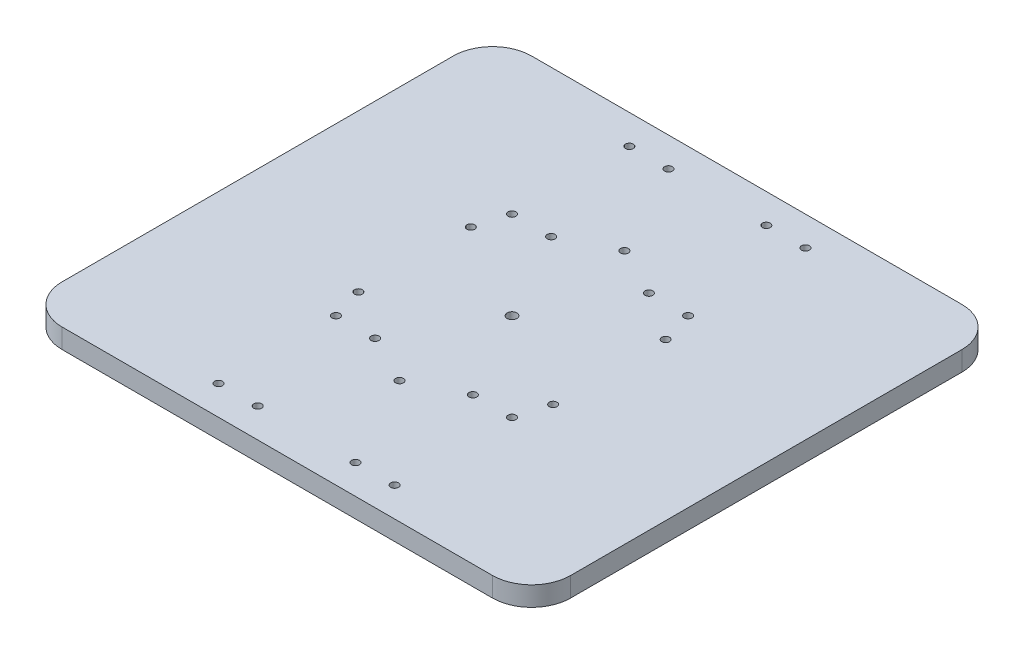
ISO-10303-21;
HEADER;
FILE_DESCRIPTION(('STEP AP214'),'2;1');
FILE_NAME('part.step','',(''),(''),'','','');
FILE_SCHEMA(('AUTOMOTIVE_DESIGN { 1 0 10303 214 1 1 1 1 }'));
ENDSEC;
DATA;
#1=APPLICATION_CONTEXT('core data for automotive mechanical design processes');
#2=APPLICATION_PROTOCOL_DEFINITION('international standard','automotive_design',2000,#1);
#3=PRODUCT_CONTEXT('',#1,'mechanical');
#4=PRODUCT('Part','Part','',(#3));
#5=PRODUCT_RELATED_PRODUCT_CATEGORY('part','',(#4));
#6=PRODUCT_DEFINITION_FORMATION('','',#4);
#7=PRODUCT_DEFINITION_CONTEXT('part definition',#1,'design');
#8=PRODUCT_DEFINITION('design','',#6,#7);
#9=PRODUCT_DEFINITION_SHAPE('','',#8);
#10=(LENGTH_UNIT() NAMED_UNIT(*) SI_UNIT(.MILLI.,.METRE.));
#11=(NAMED_UNIT(*) PLANE_ANGLE_UNIT() SI_UNIT($,.RADIAN.));
#12=(NAMED_UNIT(*) SI_UNIT($,.STERADIAN.) SOLID_ANGLE_UNIT());
#13=UNCERTAINTY_MEASURE_WITH_UNIT(LENGTH_MEASURE(1.E-05),#10,'distance_accuracy_value','');
#14=(GEOMETRIC_REPRESENTATION_CONTEXT(3) GLOBAL_UNCERTAINTY_ASSIGNED_CONTEXT((#13)) GLOBAL_UNIT_ASSIGNED_CONTEXT((#10,
#11,#12)) REPRESENTATION_CONTEXT('',''));
#15=CARTESIAN_POINT('',(0.,0.,0.));
#16=DIRECTION('',(0.,0.,1.));
#17=DIRECTION('',(1.,0.,0.));
#18=AXIS2_PLACEMENT_3D('',#15,#16,#17);
#19=CARTESIAN_POINT('',(130.,10.,120.));
#20=DIRECTION('',(-1.,0.,0.));
#21=DIRECTION('',(0.,0.,1.));
#22=AXIS2_PLACEMENT_3D('',#19,#20,#21);
#23=PLANE('',#22);
#24=DIRECTION('',(0.,0.,-1.));
#25=VECTOR('',#24,1.);
#26=CARTESIAN_POINT('',(130.,0.,120.));
#27=LINE('',#26,#25);
#28=CARTESIAN_POINT('',(130.,0.,100.));
#29=VERTEX_POINT('',#28);
#30=CARTESIAN_POINT('',(130.,0.,-100.));
#31=VERTEX_POINT('',#30);
#32=EDGE_CURVE('E130',#29,#31,#27,.T.);
#33=ORIENTED_EDGE('',*,*,#32,.T.);
#34=DIRECTION('',(0.,-1.,0.));
#35=VECTOR('',#34,1.);
#36=CARTESIAN_POINT('',(130.,10.,-100.));
#37=LINE('',#36,#35);
#38=CARTESIAN_POINT('',(130.,10.,-100.));
#39=VERTEX_POINT('',#38);
#40=EDGE_CURVE('E108',#31,#39,#37,.F.);
#41=ORIENTED_EDGE('',*,*,#40,.T.);
#42=DIRECTION('',(0.,0.,-1.));
#43=VECTOR('',#42,1.);
#44=CARTESIAN_POINT('',(130.,10.,120.));
#45=LINE('',#44,#43);
#46=CARTESIAN_POINT('',(130.,10.,100.));
#47=VERTEX_POINT('',#46);
#48=EDGE_CURVE('E140',#47,#39,#45,.T.);
#49=ORIENTED_EDGE('',*,*,#48,.F.);
#50=DIRECTION('',(0.,-1.,0.));
#51=VECTOR('',#50,1.);
#52=CARTESIAN_POINT('',(130.,10.,100.));
#53=LINE('',#52,#51);
#54=EDGE_CURVE('E113',#47,#29,#53,.T.);
#55=ORIENTED_EDGE('',*,*,#54,.T.);
#56=EDGE_LOOP('',(#33,#41,#49,#55));
#57=FACE_BOUND('',#56,.T.);
#58=ADVANCED_FACE('F37',(#57),#23,.F.);
#59=CARTESIAN_POINT('',(-130.,10.,-120.));
#60=DIRECTION('',(0.,0.,1.));
#61=DIRECTION('',(1.,0.,0.));
#62=AXIS2_PLACEMENT_3D('',#59,#60,#61);
#63=PLANE('',#62);
#64=DIRECTION('',(-1.,0.,0.));
#65=VECTOR('',#64,1.);
#66=CARTESIAN_POINT('',(-130.,10.,-120.));
#67=LINE('',#66,#65);
#68=CARTESIAN_POINT('',(110.,10.,-120.));
#69=VERTEX_POINT('',#68);
#70=CARTESIAN_POINT('',(-110.,10.,-120.));
#71=VERTEX_POINT('',#70);
#72=EDGE_CURVE('E123',#69,#71,#67,.T.);
#73=ORIENTED_EDGE('',*,*,#72,.F.);
#74=DIRECTION('',(0.,-1.,0.));
#75=VECTOR('',#74,1.);
#76=CARTESIAN_POINT('',(110.,10.,-120.));
#77=LINE('',#76,#75);
#78=CARTESIAN_POINT('',(110.,0.,-120.));
#79=VERTEX_POINT('',#78);
#80=EDGE_CURVE('E107',#69,#79,#77,.T.);
#81=ORIENTED_EDGE('',*,*,#80,.T.);
#82=DIRECTION('',(-1.,0.,0.));
#83=VECTOR('',#82,1.);
#84=CARTESIAN_POINT('',(-130.,0.,-120.));
#85=LINE('',#84,#83);
#86=CARTESIAN_POINT('',(-110.,0.,-120.));
#87=VERTEX_POINT('',#86);
#88=EDGE_CURVE('E120',#79,#87,#85,.T.);
#89=ORIENTED_EDGE('',*,*,#88,.T.);
#90=DIRECTION('',(0.,-1.,0.));
#91=VECTOR('',#90,1.);
#92=CARTESIAN_POINT('',(-110.,10.,-120.));
#93=LINE('',#92,#91);
#94=EDGE_CURVE('E125',#87,#71,#93,.F.);
#95=ORIENTED_EDGE('',*,*,#94,.T.);
#96=EDGE_LOOP('',(#73,#81,#89,#95));
#97=FACE_BOUND('',#96,.T.);
#98=ADVANCED_FACE('F119',(#97),#63,.F.);
#99=CARTESIAN_POINT('',(-130.,10.,120.));
#100=DIRECTION('',(1.,0.,0.));
#101=DIRECTION('',(0.,0.,-1.));
#102=AXIS2_PLACEMENT_3D('',#99,#100,#101);
#103=PLANE('',#102);
#104=DIRECTION('',(0.,0.,1.));
#105=VECTOR('',#104,1.);
#106=CARTESIAN_POINT('',(-130.,0.,120.));
#107=LINE('',#106,#105);
#108=CARTESIAN_POINT('',(-130.,0.,-100.));
#109=VERTEX_POINT('',#108);
#110=CARTESIAN_POINT('',(-130.,0.,100.));
#111=VERTEX_POINT('',#110);
#112=EDGE_CURVE('E129',#109,#111,#107,.T.);
#113=ORIENTED_EDGE('',*,*,#112,.T.);
#114=DIRECTION('',(0.,-1.,0.));
#115=VECTOR('',#114,1.);
#116=CARTESIAN_POINT('',(-130.,10.,100.));
#117=LINE('',#116,#115);
#118=CARTESIAN_POINT('',(-130.,10.,100.));
#119=VERTEX_POINT('',#118);
#120=EDGE_CURVE('E11',#111,#119,#117,.F.);
#121=ORIENTED_EDGE('',*,*,#120,.T.);
#122=DIRECTION('',(0.,0.,1.));
#123=VECTOR('',#122,1.);
#124=CARTESIAN_POINT('',(-130.,10.,120.));
#125=LINE('',#124,#123);
#126=CARTESIAN_POINT('',(-130.,10.,-100.));
#127=VERTEX_POINT('',#126);
#128=EDGE_CURVE('E166',#127,#119,#125,.T.);
#129=ORIENTED_EDGE('',*,*,#128,.F.);
#130=DIRECTION('',(0.,-1.,0.));
#131=VECTOR('',#130,1.);
#132=CARTESIAN_POINT('',(-130.,10.,-100.));
#133=LINE('',#132,#131);
#134=EDGE_CURVE('E45',#127,#109,#133,.T.);
#135=ORIENTED_EDGE('',*,*,#134,.T.);
#136=EDGE_LOOP('',(#113,#121,#129,#135));
#137=FACE_BOUND('',#136,.T.);
#138=ADVANCED_FACE('F164',(#137),#103,.F.);
#139=CARTESIAN_POINT('',(-130.,10.,120.));
#140=DIRECTION('',(0.,0.,-1.));
#141=DIRECTION('',(-1.,0.,0.));
#142=AXIS2_PLACEMENT_3D('',#139,#140,#141);
#143=PLANE('',#142);
#144=DIRECTION('',(1.,0.,0.));
#145=VECTOR('',#144,1.);
#146=CARTESIAN_POINT('',(-130.,0.,120.));
#147=LINE('',#146,#145);
#148=CARTESIAN_POINT('',(-110.,0.,120.));
#149=VERTEX_POINT('',#148);
#150=CARTESIAN_POINT('',(110.,0.,120.));
#151=VERTEX_POINT('',#150);
#152=EDGE_CURVE('E133',#149,#151,#147,.T.);
#153=ORIENTED_EDGE('',*,*,#152,.T.);
#154=DIRECTION('',(0.,-1.,0.));
#155=VECTOR('',#154,1.);
#156=CARTESIAN_POINT('',(110.,10.,120.));
#157=LINE('',#156,#155);
#158=CARTESIAN_POINT('',(110.,10.,120.));
#159=VERTEX_POINT('',#158);
#160=EDGE_CURVE('E52',#151,#159,#157,.F.);
#161=ORIENTED_EDGE('',*,*,#160,.T.);
#162=DIRECTION('',(1.,0.,0.));
#163=VECTOR('',#162,1.);
#164=CARTESIAN_POINT('',(-130.,10.,120.));
#165=LINE('',#164,#163);
#166=CARTESIAN_POINT('',(-110.,10.,120.));
#167=VERTEX_POINT('',#166);
#168=EDGE_CURVE('E141',#167,#159,#165,.T.);
#169=ORIENTED_EDGE('',*,*,#168,.F.);
#170=DIRECTION('',(0.,-1.,0.));
#171=VECTOR('',#170,1.);
#172=CARTESIAN_POINT('',(-110.,10.,120.));
#173=LINE('',#172,#171);
#174=EDGE_CURVE('E157',#167,#149,#173,.T.);
#175=ORIENTED_EDGE('',*,*,#174,.T.);
#176=EDGE_LOOP('',(#153,#161,#169,#175));
#177=FACE_BOUND('',#176,.T.);
#178=ADVANCED_FACE('F173',(#177),#143,.F.);
#179=CARTESIAN_POINT('',(0.,10.,0.));
#180=DIRECTION('',(0.,-1.,0.));
#181=DIRECTION('',(0.,0.,-1.));
#182=AXIS2_PLACEMENT_3D('',#179,#180,#181);
#183=PLANE('',#182);
#184=CARTESIAN_POINT('',(-25.,10.,45.));
#185=DIRECTION('',(0.,1.,0.));
#186=DIRECTION('',(0.,0.,1.));
#187=AXIS2_PLACEMENT_3D('',#184,#185,#186);
#188=CIRCLE('',#187,2.);
#189=CARTESIAN_POINT('',(-25.,10.,47.));
#190=VERTEX_POINT('',#189);
#191=EDGE_CURVE('E264',#190,#190,#188,.T.);
#192=ORIENTED_EDGE('',*,*,#191,.F.);
#193=EDGE_LOOP('',(#192));
#194=FACE_BOUND('',#193,.T.);
#195=CARTESIAN_POINT('',(-45.,10.,45.));
#196=DIRECTION('',(0.,1.,0.));
#197=DIRECTION('',(0.,0.,1.));
#198=AXIS2_PLACEMENT_3D('',#195,#196,#197);
#199=CIRCLE('',#198,2.);
#200=CARTESIAN_POINT('',(-45.,10.,47.));
#201=VERTEX_POINT('',#200);
#202=EDGE_CURVE('E277',#201,#201,#199,.T.);
#203=ORIENTED_EDGE('',*,*,#202,.F.);
#204=EDGE_LOOP('',(#203));
#205=FACE_BOUND('',#204,.T.);
#206=CARTESIAN_POINT('',(25.,10.,-45.));
#207=DIRECTION('',(0.,1.,0.));
#208=DIRECTION('',(0.,0.,1.));
#209=AXIS2_PLACEMENT_3D('',#206,#207,#208);
#210=CIRCLE('',#209,2.00000000000001);
#211=CARTESIAN_POINT('',(25.,10.,-43.));
#212=VERTEX_POINT('',#211);
#213=EDGE_CURVE('E270',#212,#212,#210,.T.);
#214=ORIENTED_EDGE('',*,*,#213,.F.);
#215=EDGE_LOOP('',(#214));
#216=FACE_BOUND('',#215,.T.);
#217=CARTESIAN_POINT('',(25.,10.,45.));
#218=DIRECTION('',(0.,1.,0.));
#219=DIRECTION('',(0.,0.,1.));
#220=AXIS2_PLACEMENT_3D('',#217,#218,#219);
#221=CIRCLE('',#220,2.00000000000001);
#222=CARTESIAN_POINT('',(25.,10.,47.));
#223=VERTEX_POINT('',#222);
#224=EDGE_CURVE('E252',#223,#223,#221,.T.);
#225=ORIENTED_EDGE('',*,*,#224,.F.);
#226=EDGE_LOOP('',(#225));
#227=FACE_BOUND('',#226,.T.);
#228=CARTESIAN_POINT('',(45.,10.,45.));
#229=DIRECTION('',(0.,1.,0.));
#230=DIRECTION('',(0.,0.,1.));
#231=AXIS2_PLACEMENT_3D('',#228,#229,#230);
#232=CIRCLE('',#231,2.);
#233=CARTESIAN_POINT('',(45.,10.,47.));
#234=VERTEX_POINT('',#233);
#235=EDGE_CURVE('E259',#234,#234,#232,.T.);
#236=ORIENTED_EDGE('',*,*,#235,.F.);
#237=EDGE_LOOP('',(#236));
#238=FACE_BOUND('',#237,.T.);
#239=CARTESIAN_POINT('',(-25.,10.,105.));
#240=DIRECTION('',(0.,1.,0.));
#241=DIRECTION('',(0.,0.,1.));
#242=AXIS2_PLACEMENT_3D('',#239,#240,#241);
#243=CIRCLE('',#242,2.00000000000001);
#244=CARTESIAN_POINT('',(-25.,10.,107.));
#245=VERTEX_POINT('',#244);
#246=EDGE_CURVE('E300',#245,#245,#243,.T.);
#247=ORIENTED_EDGE('',*,*,#246,.F.);
#248=EDGE_LOOP('',(#247));
#249=FACE_BOUND('',#248,.T.);
#250=CARTESIAN_POINT('',(25.,10.,105.));
#251=DIRECTION('',(0.,1.,0.));
#252=DIRECTION('',(0.,0.,1.));
#253=AXIS2_PLACEMENT_3D('',#250,#251,#252);
#254=CIRCLE('',#253,2.);
#255=CARTESIAN_POINT('',(25.,10.,107.));
#256=VERTEX_POINT('',#255);
#257=EDGE_CURVE('E312',#256,#256,#254,.T.);
#258=ORIENTED_EDGE('',*,*,#257,.F.);
#259=EDGE_LOOP('',(#258));
#260=FACE_BOUND('',#259,.T.);
#261=CARTESIAN_POINT('',(-49.796460717604,10.,-28.7499999999978));
#262=DIRECTION('',(0.,1.,0.));
#263=DIRECTION('',(0.,0.,1.));
#264=AXIS2_PLACEMENT_3D('',#261,#262,#263);
#265=CIRCLE('',#264,2.00000000000247);
#266=CARTESIAN_POINT('',(-49.796460717604,10.,-26.7499999999954));
#267=VERTEX_POINT('',#266);
#268=EDGE_CURVE('E306',#267,#267,#265,.T.);
#269=ORIENTED_EDGE('',*,*,#268,.F.);
#270=EDGE_LOOP('',(#269));
#271=FACE_BOUND('',#270,.T.);
#272=CARTESIAN_POINT('',(-45.,10.,105.));
#273=DIRECTION('',(0.,1.,0.));
#274=DIRECTION('',(0.,0.,1.));
#275=AXIS2_PLACEMENT_3D('',#272,#273,#274);
#276=CIRCLE('',#275,2.);
#277=CARTESIAN_POINT('',(-45.,10.,107.));
#278=VERTEX_POINT('',#277);
#279=EDGE_CURVE('E282',#278,#278,#276,.T.);
#280=ORIENTED_EDGE('',*,*,#279,.F.);
#281=EDGE_LOOP('',(#280));
#282=FACE_BOUND('',#281,.T.);
#283=CARTESIAN_POINT('',(-49.7964607176015,10.,28.7500000000021));
#284=DIRECTION('',(0.,1.,0.));
#285=DIRECTION('',(0.,0.,1.));
#286=AXIS2_PLACEMENT_3D('',#283,#284,#285);
#287=CIRCLE('',#286,2.00000000000465);
#288=CARTESIAN_POINT('',(-49.7964607176015,10.,30.7500000000068));
#289=VERTEX_POINT('',#288);
#290=EDGE_CURVE('E289',#289,#289,#287,.T.);
#291=ORIENTED_EDGE('',*,*,#290,.F.);
#292=EDGE_LOOP('',(#291));
#293=FACE_BOUND('',#292,.T.);
#294=CARTESIAN_POINT('',(-25.,10.,-45.));
#295=DIRECTION('',(0.,1.,0.));
#296=DIRECTION('',(0.,0.,1.));
#297=AXIS2_PLACEMENT_3D('',#294,#295,#296);
#298=CIRCLE('',#297,2.);
#299=CARTESIAN_POINT('',(-25.,10.,-43.));
#300=VERTEX_POINT('',#299);
#301=EDGE_CURVE('E295',#300,#300,#298,.T.);
#302=ORIENTED_EDGE('',*,*,#301,.F.);
#303=EDGE_LOOP('',(#302));
#304=FACE_BOUND('',#303,.T.);
#305=CARTESIAN_POINT('',(-45.,10.,-105.));
#306=DIRECTION('',(0.,1.,0.));
#307=DIRECTION('',(0.,0.,1.));
#308=AXIS2_PLACEMENT_3D('',#305,#306,#307);
#309=CIRCLE('',#308,2.);
#310=CARTESIAN_POINT('',(-45.,10.,-103.));
#311=VERTEX_POINT('',#310);
#312=EDGE_CURVE('E198',#311,#311,#309,.T.);
#313=ORIENTED_EDGE('',*,*,#312,.F.);
#314=EDGE_LOOP('',(#313));
#315=FACE_BOUND('',#314,.T.);
#316=CARTESIAN_POINT('',(45.,10.,-105.));
#317=DIRECTION('',(0.,1.,0.));
#318=DIRECTION('',(0.,0.,1.));
#319=AXIS2_PLACEMENT_3D('',#316,#317,#318);
#320=CIRCLE('',#319,2.);
#321=CARTESIAN_POINT('',(45.,10.,-103.));
#322=VERTEX_POINT('',#321);
#323=EDGE_CURVE('E205',#322,#322,#320,.T.);
#324=ORIENTED_EDGE('',*,*,#323,.F.);
#325=EDGE_LOOP('',(#324));
#326=FACE_BOUND('',#325,.T.);
#327=CARTESIAN_POINT('',(-45.,10.,-45.));
#328=DIRECTION('',(0.,1.,0.));
#329=DIRECTION('',(0.,0.,1.));
#330=AXIS2_PLACEMENT_3D('',#327,#328,#329);
#331=CIRCLE('',#330,2.);
#332=CARTESIAN_POINT('',(-45.,10.,-43.));
#333=VERTEX_POINT('',#332);
#334=EDGE_CURVE('E211',#333,#333,#331,.T.);
#335=ORIENTED_EDGE('',*,*,#334,.F.);
#336=EDGE_LOOP('',(#335));
#337=FACE_BOUND('',#336,.T.);
#338=CARTESIAN_POINT('',(45.,10.,-45.));
#339=DIRECTION('',(0.,1.,0.));
#340=DIRECTION('',(0.,0.,1.));
#341=AXIS2_PLACEMENT_3D('',#338,#339,#340);
#342=CIRCLE('',#341,2.);
#343=CARTESIAN_POINT('',(45.,10.,-43.));
#344=VERTEX_POINT('',#343);
#345=EDGE_CURVE('E186',#344,#344,#342,.T.);
#346=ORIENTED_EDGE('',*,*,#345,.F.);
#347=EDGE_LOOP('',(#346));
#348=FACE_BOUND('',#347,.T.);
#349=CARTESIAN_POINT('',(0.,10.,-57.5));
#350=DIRECTION('',(0.,1.,0.));
#351=DIRECTION('',(0.,0.,1.));
#352=AXIS2_PLACEMENT_3D('',#349,#350,#351);
#353=CIRCLE('',#352,2.);
#354=CARTESIAN_POINT('',(0.,10.,-55.5));
#355=VERTEX_POINT('',#354);
#356=EDGE_CURVE('E193',#355,#355,#353,.T.);
#357=ORIENTED_EDGE('',*,*,#356,.F.);
#358=EDGE_LOOP('',(#357));
#359=FACE_BOUND('',#358,.T.);
#360=CARTESIAN_POINT('',(25.,10.,-105.));
#361=DIRECTION('',(0.,1.,0.));
#362=DIRECTION('',(0.,0.,1.));
#363=AXIS2_PLACEMENT_3D('',#360,#361,#362);
#364=CIRCLE('',#363,2.);
#365=CARTESIAN_POINT('',(25.,10.,-103.));
#366=VERTEX_POINT('',#365);
#367=EDGE_CURVE('E247',#366,#366,#364,.T.);
#368=ORIENTED_EDGE('',*,*,#367,.F.);
#369=EDGE_LOOP('',(#368));
#370=FACE_BOUND('',#369,.T.);
#371=CARTESIAN_POINT('',(-25.,10.,-105.));
#372=DIRECTION('',(0.,1.,0.));
#373=DIRECTION('',(0.,0.,1.));
#374=AXIS2_PLACEMENT_3D('',#371,#372,#373);
#375=CIRCLE('',#374,2.00000000000001);
#376=CARTESIAN_POINT('',(-25.,10.,-103.));
#377=VERTEX_POINT('',#376);
#378=EDGE_CURVE('E241',#377,#377,#375,.T.);
#379=ORIENTED_EDGE('',*,*,#378,.F.);
#380=EDGE_LOOP('',(#379));
#381=FACE_BOUND('',#380,.T.);
#382=CARTESIAN_POINT('',(4.8886614385545E-12,10.,57.5));
#383=DIRECTION('',(0.,1.,0.));
#384=DIRECTION('',(0.,0.,1.));
#385=AXIS2_PLACEMENT_3D('',#382,#383,#384);
#386=CIRCLE('',#385,2.00000000000506);
#387=CARTESIAN_POINT('',(4.8886614385545E-12,10.,59.5000000000051));
#388=VERTEX_POINT('',#387);
#389=EDGE_CURVE('E223',#388,#388,#386,.T.);
#390=ORIENTED_EDGE('',*,*,#389,.F.);
#391=EDGE_LOOP('',(#390));
#392=FACE_BOUND('',#391,.T.);
#393=CARTESIAN_POINT('',(45.,10.,105.));
#394=DIRECTION('',(0.,1.,0.));
#395=DIRECTION('',(0.,0.,1.));
#396=AXIS2_PLACEMENT_3D('',#393,#394,#395);
#397=CIRCLE('',#396,2.);
#398=CARTESIAN_POINT('',(45.,10.,107.));
#399=VERTEX_POINT('',#398);
#400=EDGE_CURVE('E224',#399,#399,#397,.T.);
#401=ORIENTED_EDGE('',*,*,#400,.F.);
#402=EDGE_LOOP('',(#401));
#403=FACE_BOUND('',#402,.T.);
#404=CARTESIAN_POINT('',(49.7964607176064,10.,-28.7500000000021));
#405=DIRECTION('',(0.,1.,0.));
#406=DIRECTION('',(0.,0.,1.));
#407=AXIS2_PLACEMENT_3D('',#404,#405,#406);
#408=CIRCLE('',#407,2.00000000000069);
#409=CARTESIAN_POINT('',(49.7964607176064,10.,-26.7500000000014));
#410=VERTEX_POINT('',#409);
#411=EDGE_CURVE('E231',#410,#410,#408,.T.);
#412=ORIENTED_EDGE('',*,*,#411,.F.);
#413=EDGE_LOOP('',(#412));
#414=FACE_BOUND('',#413,.T.);
#415=CARTESIAN_POINT('',(49.7964607176089,10.,28.7499999999979));
#416=DIRECTION('',(0.,1.,0.));
#417=DIRECTION('',(0.,0.,1.));
#418=AXIS2_PLACEMENT_3D('',#415,#416,#417);
#419=CIRCLE('',#418,2.00000000000315);
#420=CARTESIAN_POINT('',(49.7964607176089,10.,30.750000000001));
#421=VERTEX_POINT('',#420);
#422=EDGE_CURVE('E216',#421,#421,#419,.T.);
#423=ORIENTED_EDGE('',*,*,#422,.F.);
#424=EDGE_LOOP('',(#423));
#425=FACE_BOUND('',#424,.T.);
#426=CARTESIAN_POINT('',(0.,10.,0.));
#427=DIRECTION('',(0.,1.,0.));
#428=DIRECTION('',(0.,0.,1.));
#429=AXIS2_PLACEMENT_3D('',#426,#427,#428);
#430=CIRCLE('',#429,2.5);
#431=CARTESIAN_POINT('',(0.,10.,2.5));
#432=VERTEX_POINT('',#431);
#433=EDGE_CURVE('E180',#432,#432,#430,.T.);
#434=ORIENTED_EDGE('',*,*,#433,.F.);
#435=EDGE_LOOP('',(#434));
#436=FACE_BOUND('',#435,.T.);
#437=ORIENTED_EDGE('',*,*,#48,.T.);
#438=CARTESIAN_POINT('',(110.,10.,-100.));
#439=DIRECTION('',(0.,-1.,0.));
#440=DIRECTION('',(0.,0.,-1.));
#441=AXIS2_PLACEMENT_3D('',#438,#439,#440);
#442=CIRCLE('',#441,20.);
#443=EDGE_CURVE('E155',#39,#69,#442,.F.);
#444=ORIENTED_EDGE('',*,*,#443,.T.);
#445=ORIENTED_EDGE('',*,*,#72,.T.);
#446=CARTESIAN_POINT('',(-110.,10.,-100.));
#447=DIRECTION('',(0.,-1.,0.));
#448=DIRECTION('',(0.,0.,-1.));
#449=AXIS2_PLACEMENT_3D('',#446,#447,#448);
#450=CIRCLE('',#449,20.);
#451=EDGE_CURVE('E150',#71,#127,#450,.F.);
#452=ORIENTED_EDGE('',*,*,#451,.T.);
#453=ORIENTED_EDGE('',*,*,#128,.T.);
#454=CARTESIAN_POINT('',(-110.,10.,100.));
#455=DIRECTION('',(0.,-1.,0.));
#456=DIRECTION('',(0.,0.,-1.));
#457=AXIS2_PLACEMENT_3D('',#454,#455,#456);
#458=CIRCLE('',#457,20.);
#459=EDGE_CURVE('E59',#119,#167,#458,.F.);
#460=ORIENTED_EDGE('',*,*,#459,.T.);
#461=ORIENTED_EDGE('',*,*,#168,.T.);
#462=CARTESIAN_POINT('',(110.,10.,100.));
#463=DIRECTION('',(0.,-1.,0.));
#464=DIRECTION('',(0.,0.,-1.));
#465=AXIS2_PLACEMENT_3D('',#462,#463,#464);
#466=CIRCLE('',#465,20.);
#467=EDGE_CURVE('E153',#159,#47,#466,.F.);
#468=ORIENTED_EDGE('',*,*,#467,.T.);
#469=EDGE_LOOP('',(#437,#444,#445,#452,#453,#460,#461,#468));
#470=FACE_BOUND('',#469,.T.);
#471=ADVANCED_FACE('F328',(#194,#205,#216,#227,#238,#249,#260,#271,#282,#293,#304,#315,#326,
#337,#348,#359,#370,#381,#392,#403,#414,#425,#436,#470),#183,.F.);
#472=CARTESIAN_POINT('',(0.,0.,0.));
#473=DIRECTION('',(0.,-1.,0.));
#474=DIRECTION('',(0.,0.,-1.));
#475=AXIS2_PLACEMENT_3D('',#472,#473,#474);
#476=PLANE('',#475);
#477=CARTESIAN_POINT('',(-25.,0.,45.));
#478=DIRECTION('',(0.,1.,0.));
#479=DIRECTION('',(0.,0.,1.));
#480=AXIS2_PLACEMENT_3D('',#477,#478,#479);
#481=CIRCLE('',#480,2.);
#482=CARTESIAN_POINT('',(-25.,0.,47.));
#483=VERTEX_POINT('',#482);
#484=EDGE_CURVE('E256',#483,#483,#481,.T.);
#485=ORIENTED_EDGE('',*,*,#484,.T.);
#486=EDGE_LOOP('',(#485));
#487=FACE_BOUND('',#486,.T.);
#488=CARTESIAN_POINT('',(-45.,0.,45.));
#489=DIRECTION('',(0.,1.,0.));
#490=DIRECTION('',(0.,0.,1.));
#491=AXIS2_PLACEMENT_3D('',#488,#489,#490);
#492=CIRCLE('',#491,2.);
#493=CARTESIAN_POINT('',(-45.,0.,47.));
#494=VERTEX_POINT('',#493);
#495=EDGE_CURVE('E267',#494,#494,#492,.T.);
#496=ORIENTED_EDGE('',*,*,#495,.T.);
#497=EDGE_LOOP('',(#496));
#498=FACE_BOUND('',#497,.T.);
#499=CARTESIAN_POINT('',(25.,0.,-45.));
#500=DIRECTION('',(0.,1.,0.));
#501=DIRECTION('',(0.,0.,1.));
#502=AXIS2_PLACEMENT_3D('',#499,#500,#501);
#503=CIRCLE('',#502,2.00000000000001);
#504=CARTESIAN_POINT('',(25.,0.,-43.));
#505=VERTEX_POINT('',#504);
#506=EDGE_CURVE('E273',#505,#505,#503,.T.);
#507=ORIENTED_EDGE('',*,*,#506,.T.);
#508=EDGE_LOOP('',(#507));
#509=FACE_BOUND('',#508,.T.);
#510=CARTESIAN_POINT('',(25.,0.,45.));
#511=DIRECTION('',(0.,1.,0.));
#512=DIRECTION('',(0.,0.,1.));
#513=AXIS2_PLACEMENT_3D('',#510,#511,#512);
#514=CIRCLE('',#513,2.00000000000001);
#515=CARTESIAN_POINT('',(25.,0.,47.));
#516=VERTEX_POINT('',#515);
#517=EDGE_CURVE('E255',#516,#516,#514,.T.);
#518=ORIENTED_EDGE('',*,*,#517,.T.);
#519=EDGE_LOOP('',(#518));
#520=FACE_BOUND('',#519,.T.);
#521=CARTESIAN_POINT('',(45.,0.,45.));
#522=DIRECTION('',(0.,1.,0.));
#523=DIRECTION('',(0.,0.,1.));
#524=AXIS2_PLACEMENT_3D('',#521,#522,#523);
#525=CIRCLE('',#524,2.);
#526=CARTESIAN_POINT('',(45.,0.,47.));
#527=VERTEX_POINT('',#526);
#528=EDGE_CURVE('E228',#527,#527,#525,.T.);
#529=ORIENTED_EDGE('',*,*,#528,.T.);
#530=EDGE_LOOP('',(#529));
#531=FACE_BOUND('',#530,.T.);
#532=CARTESIAN_POINT('',(-25.,0.,105.));
#533=DIRECTION('',(0.,1.,0.));
#534=DIRECTION('',(0.,0.,1.));
#535=AXIS2_PLACEMENT_3D('',#532,#533,#534);
#536=CIRCLE('',#535,2.00000000000001);
#537=CARTESIAN_POINT('',(-25.,0.,107.));
#538=VERTEX_POINT('',#537);
#539=EDGE_CURVE('E286',#538,#538,#536,.T.);
#540=ORIENTED_EDGE('',*,*,#539,.T.);
#541=EDGE_LOOP('',(#540));
#542=FACE_BOUND('',#541,.T.);
#543=CARTESIAN_POINT('',(25.,0.,105.));
#544=DIRECTION('',(0.,1.,0.));
#545=DIRECTION('',(0.,0.,1.));
#546=AXIS2_PLACEMENT_3D('',#543,#544,#545);
#547=CIRCLE('',#546,2.);
#548=CARTESIAN_POINT('',(25.,0.,107.));
#549=VERTEX_POINT('',#548);
#550=EDGE_CURVE('E303',#549,#549,#547,.T.);
#551=ORIENTED_EDGE('',*,*,#550,.T.);
#552=EDGE_LOOP('',(#551));
#553=FACE_BOUND('',#552,.T.);
#554=CARTESIAN_POINT('',(-49.796460717604,0.,-28.7499999999978));
#555=DIRECTION('',(0.,1.,0.));
#556=DIRECTION('',(0.,0.,1.));
#557=AXIS2_PLACEMENT_3D('',#554,#555,#556);
#558=CIRCLE('',#557,2.00000000000247);
#559=CARTESIAN_POINT('',(-49.796460717604,0.,-26.7499999999954));
#560=VERTEX_POINT('',#559);
#561=EDGE_CURVE('E309',#560,#560,#558,.T.);
#562=ORIENTED_EDGE('',*,*,#561,.T.);
#563=EDGE_LOOP('',(#562));
#564=FACE_BOUND('',#563,.T.);
#565=CARTESIAN_POINT('',(-45.,0.,105.));
#566=DIRECTION('',(0.,1.,0.));
#567=DIRECTION('',(0.,0.,1.));
#568=AXIS2_PLACEMENT_3D('',#565,#566,#567);
#569=CIRCLE('',#568,2.);
#570=CARTESIAN_POINT('',(-45.,0.,107.));
#571=VERTEX_POINT('',#570);
#572=EDGE_CURVE('E285',#571,#571,#569,.T.);
#573=ORIENTED_EDGE('',*,*,#572,.T.);
#574=EDGE_LOOP('',(#573));
#575=FACE_BOUND('',#574,.T.);
#576=CARTESIAN_POINT('',(-49.7964607176015,0.,28.7500000000021));
#577=DIRECTION('',(0.,1.,0.));
#578=DIRECTION('',(0.,0.,1.));
#579=AXIS2_PLACEMENT_3D('',#576,#577,#578);
#580=CIRCLE('',#579,2.00000000000465);
#581=CARTESIAN_POINT('',(-49.7964607176015,0.,30.7500000000068));
#582=VERTEX_POINT('',#581);
#583=EDGE_CURVE('E292',#582,#582,#580,.T.);
#584=ORIENTED_EDGE('',*,*,#583,.T.);
#585=EDGE_LOOP('',(#584));
#586=FACE_BOUND('',#585,.T.);
#587=CARTESIAN_POINT('',(-25.,0.,-45.));
#588=DIRECTION('',(0.,1.,0.));
#589=DIRECTION('',(0.,0.,1.));
#590=AXIS2_PLACEMENT_3D('',#587,#588,#589);
#591=CIRCLE('',#590,2.);
#592=CARTESIAN_POINT('',(-25.,0.,-43.));
#593=VERTEX_POINT('',#592);
#594=EDGE_CURVE('E274',#593,#593,#591,.T.);
#595=ORIENTED_EDGE('',*,*,#594,.T.);
#596=EDGE_LOOP('',(#595));
#597=FACE_BOUND('',#596,.T.);
#598=CARTESIAN_POINT('',(-45.,0.,-105.));
#599=DIRECTION('',(0.,1.,0.));
#600=DIRECTION('',(0.,0.,1.));
#601=AXIS2_PLACEMENT_3D('',#598,#599,#600);
#602=CIRCLE('',#601,2.);
#603=CARTESIAN_POINT('',(-45.,0.,-103.));
#604=VERTEX_POINT('',#603);
#605=EDGE_CURVE('E201',#604,#604,#602,.T.);
#606=ORIENTED_EDGE('',*,*,#605,.T.);
#607=EDGE_LOOP('',(#606));
#608=FACE_BOUND('',#607,.T.);
#609=CARTESIAN_POINT('',(45.,0.,-105.));
#610=DIRECTION('',(0.,1.,0.));
#611=DIRECTION('',(0.,0.,1.));
#612=AXIS2_PLACEMENT_3D('',#609,#610,#611);
#613=CIRCLE('',#612,2.);
#614=CARTESIAN_POINT('',(45.,0.,-103.));
#615=VERTEX_POINT('',#614);
#616=EDGE_CURVE('E208',#615,#615,#613,.T.);
#617=ORIENTED_EDGE('',*,*,#616,.T.);
#618=EDGE_LOOP('',(#617));
#619=FACE_BOUND('',#618,.T.);
#620=CARTESIAN_POINT('',(-45.,0.,-45.));
#621=DIRECTION('',(0.,1.,0.));
#622=DIRECTION('',(0.,0.,1.));
#623=AXIS2_PLACEMENT_3D('',#620,#621,#622);
#624=CIRCLE('',#623,2.);
#625=CARTESIAN_POINT('',(-45.,0.,-43.));
#626=VERTEX_POINT('',#625);
#627=EDGE_CURVE('E190',#626,#626,#624,.T.);
#628=ORIENTED_EDGE('',*,*,#627,.T.);
#629=EDGE_LOOP('',(#628));
#630=FACE_BOUND('',#629,.T.);
#631=CARTESIAN_POINT('',(45.,0.,-45.));
#632=DIRECTION('',(0.,1.,0.));
#633=DIRECTION('',(0.,0.,1.));
#634=AXIS2_PLACEMENT_3D('',#631,#632,#633);
#635=CIRCLE('',#634,2.);
#636=CARTESIAN_POINT('',(45.,0.,-43.));
#637=VERTEX_POINT('',#636);
#638=EDGE_CURVE('E189',#637,#637,#635,.T.);
#639=ORIENTED_EDGE('',*,*,#638,.T.);
#640=EDGE_LOOP('',(#639));
#641=FACE_BOUND('',#640,.T.);
#642=CARTESIAN_POINT('',(0.,0.,-57.5));
#643=DIRECTION('',(0.,1.,0.));
#644=DIRECTION('',(0.,0.,1.));
#645=AXIS2_PLACEMENT_3D('',#642,#643,#644);
#646=CIRCLE('',#645,2.);
#647=CARTESIAN_POINT('',(0.,0.,-55.5));
#648=VERTEX_POINT('',#647);
#649=EDGE_CURVE('E183',#648,#648,#646,.T.);
#650=ORIENTED_EDGE('',*,*,#649,.T.);
#651=EDGE_LOOP('',(#650));
#652=FACE_BOUND('',#651,.T.);
#653=CARTESIAN_POINT('',(25.,0.,-105.));
#654=DIRECTION('',(0.,1.,0.));
#655=DIRECTION('',(0.,0.,1.));
#656=AXIS2_PLACEMENT_3D('',#653,#654,#655);
#657=CIRCLE('',#656,2.);
#658=CARTESIAN_POINT('',(25.,0.,-103.));
#659=VERTEX_POINT('',#658);
#660=EDGE_CURVE('E202',#659,#659,#657,.T.);
#661=ORIENTED_EDGE('',*,*,#660,.T.);
#662=EDGE_LOOP('',(#661));
#663=FACE_BOUND('',#662,.T.);
#664=CARTESIAN_POINT('',(-25.,0.,-105.));
#665=DIRECTION('',(0.,1.,0.));
#666=DIRECTION('',(0.,0.,1.));
#667=AXIS2_PLACEMENT_3D('',#664,#665,#666);
#668=CIRCLE('',#667,2.00000000000001);
#669=CARTESIAN_POINT('',(-25.,0.,-103.));
#670=VERTEX_POINT('',#669);
#671=EDGE_CURVE('E244',#670,#670,#668,.T.);
#672=ORIENTED_EDGE('',*,*,#671,.T.);
#673=EDGE_LOOP('',(#672));
#674=FACE_BOUND('',#673,.T.);
#675=CARTESIAN_POINT('',(4.8886614385545E-12,0.,57.5));
#676=DIRECTION('',(0.,1.,0.));
#677=DIRECTION('',(0.,0.,1.));
#678=AXIS2_PLACEMENT_3D('',#675,#676,#677);
#679=CIRCLE('',#678,2.00000000000506);
#680=CARTESIAN_POINT('',(4.8886614385545E-12,0.,59.5000000000051));
#681=VERTEX_POINT('',#680);
#682=EDGE_CURVE('E238',#681,#681,#679,.T.);
#683=ORIENTED_EDGE('',*,*,#682,.T.);
#684=EDGE_LOOP('',(#683));
#685=FACE_BOUND('',#684,.T.);
#686=CARTESIAN_POINT('',(45.,0.,105.));
#687=DIRECTION('',(0.,1.,0.));
#688=DIRECTION('',(0.,0.,1.));
#689=AXIS2_PLACEMENT_3D('',#686,#687,#688);
#690=CIRCLE('',#689,2.);
#691=CARTESIAN_POINT('',(45.,0.,107.));
#692=VERTEX_POINT('',#691);
#693=EDGE_CURVE('E227',#692,#692,#690,.T.);
#694=ORIENTED_EDGE('',*,*,#693,.T.);
#695=EDGE_LOOP('',(#694));
#696=FACE_BOUND('',#695,.T.);
#697=CARTESIAN_POINT('',(49.7964607176064,0.,-28.7500000000021));
#698=DIRECTION('',(0.,1.,0.));
#699=DIRECTION('',(0.,0.,1.));
#700=AXIS2_PLACEMENT_3D('',#697,#698,#699);
#701=CIRCLE('',#700,2.00000000000069);
#702=CARTESIAN_POINT('',(49.7964607176064,0.,-26.7500000000014));
#703=VERTEX_POINT('',#702);
#704=EDGE_CURVE('E220',#703,#703,#701,.T.);
#705=ORIENTED_EDGE('',*,*,#704,.T.);
#706=EDGE_LOOP('',(#705));
#707=FACE_BOUND('',#706,.T.);
#708=CARTESIAN_POINT('',(49.7964607176089,0.,28.7499999999979));
#709=DIRECTION('',(0.,1.,0.));
#710=DIRECTION('',(0.,0.,1.));
#711=AXIS2_PLACEMENT_3D('',#708,#709,#710);
#712=CIRCLE('',#711,2.00000000000315);
#713=CARTESIAN_POINT('',(49.7964607176089,0.,30.750000000001));
#714=VERTEX_POINT('',#713);
#715=EDGE_CURVE('E219',#714,#714,#712,.T.);
#716=ORIENTED_EDGE('',*,*,#715,.T.);
#717=EDGE_LOOP('',(#716));
#718=FACE_BOUND('',#717,.T.);
#719=CARTESIAN_POINT('',(0.,0.,0.));
#720=DIRECTION('',(0.,1.,0.));
#721=DIRECTION('',(0.,0.,1.));
#722=AXIS2_PLACEMENT_3D('',#719,#720,#721);
#723=CIRCLE('',#722,2.5);
#724=CARTESIAN_POINT('',(0.,0.,2.5));
#725=VERTEX_POINT('',#724);
#726=EDGE_CURVE('E135',#725,#725,#723,.T.);
#727=ORIENTED_EDGE('',*,*,#726,.T.);
#728=EDGE_LOOP('',(#727));
#729=FACE_BOUND('',#728,.T.);
#730=ORIENTED_EDGE('',*,*,#88,.F.);
#731=CARTESIAN_POINT('',(110.,0.,-100.));
#732=DIRECTION('',(0.,-1.,0.));
#733=DIRECTION('',(0.,0.,-1.));
#734=AXIS2_PLACEMENT_3D('',#731,#732,#733);
#735=CIRCLE('',#734,20.);
#736=EDGE_CURVE('E103',#79,#31,#735,.T.);
#737=ORIENTED_EDGE('',*,*,#736,.T.);
#738=ORIENTED_EDGE('',*,*,#32,.F.);
#739=CARTESIAN_POINT('',(110.,0.,100.));
#740=DIRECTION('',(0.,-1.,0.));
#741=DIRECTION('',(0.,0.,-1.));
#742=AXIS2_PLACEMENT_3D('',#739,#740,#741);
#743=CIRCLE('',#742,20.);
#744=EDGE_CURVE('E114',#29,#151,#743,.T.);
#745=ORIENTED_EDGE('',*,*,#744,.T.);
#746=ORIENTED_EDGE('',*,*,#152,.F.);
#747=CARTESIAN_POINT('',(-110.,0.,100.));
#748=DIRECTION('',(0.,-1.,0.));
#749=DIRECTION('',(0.,0.,-1.));
#750=AXIS2_PLACEMENT_3D('',#747,#748,#749);
#751=CIRCLE('',#750,20.);
#752=EDGE_CURVE('E144',#149,#111,#751,.T.);
#753=ORIENTED_EDGE('',*,*,#752,.T.);
#754=ORIENTED_EDGE('',*,*,#112,.F.);
#755=CARTESIAN_POINT('',(-110.,0.,-100.));
#756=DIRECTION('',(0.,-1.,0.));
#757=DIRECTION('',(0.,0.,-1.));
#758=AXIS2_PLACEMENT_3D('',#755,#756,#757);
#759=CIRCLE('',#758,20.);
#760=EDGE_CURVE('E124',#109,#87,#759,.T.);
#761=ORIENTED_EDGE('',*,*,#760,.T.);
#762=EDGE_LOOP('',(#730,#737,#738,#745,#746,#753,#754,#761));
#763=FACE_BOUND('',#762,.T.);
#764=ADVANCED_FACE('F127',(#487,#498,#509,#520,#531,#542,#553,#564,#575,#586,#597,#608,#619,
#630,#641,#652,#663,#674,#685,#696,#707,#718,#729,#763),#476,.T.);
#765=CARTESIAN_POINT('',(110.,10.,-100.));
#766=DIRECTION('',(0.,-1.,0.));
#767=DIRECTION('',(0.,0.,-1.));
#768=AXIS2_PLACEMENT_3D('',#765,#766,#767);
#769=CYLINDRICAL_SURFACE('',#768,20.);
#770=ORIENTED_EDGE('',*,*,#443,.F.);
#771=ORIENTED_EDGE('',*,*,#40,.F.);
#772=ORIENTED_EDGE('',*,*,#736,.F.);
#773=ORIENTED_EDGE('',*,*,#80,.F.);
#774=EDGE_LOOP('',(#770,#771,#772,#773));
#775=FACE_BOUND('',#774,.T.);
#776=ADVANCED_FACE('F106',(#775),#769,.T.);
#777=CARTESIAN_POINT('',(110.,10.,100.));
#778=DIRECTION('',(0.,-1.,0.));
#779=DIRECTION('',(0.,0.,-1.));
#780=AXIS2_PLACEMENT_3D('',#777,#778,#779);
#781=CYLINDRICAL_SURFACE('',#780,20.);
#782=ORIENTED_EDGE('',*,*,#467,.F.);
#783=ORIENTED_EDGE('',*,*,#160,.F.);
#784=ORIENTED_EDGE('',*,*,#744,.F.);
#785=ORIENTED_EDGE('',*,*,#54,.F.);
#786=EDGE_LOOP('',(#782,#783,#784,#785));
#787=FACE_BOUND('',#786,.T.);
#788=ADVANCED_FACE('F368',(#787),#781,.T.);
#789=CARTESIAN_POINT('',(-110.,10.,100.));
#790=DIRECTION('',(0.,-1.,0.));
#791=DIRECTION('',(0.,0.,-1.));
#792=AXIS2_PLACEMENT_3D('',#789,#790,#791);
#793=CYLINDRICAL_SURFACE('',#792,20.);
#794=ORIENTED_EDGE('',*,*,#459,.F.);
#795=ORIENTED_EDGE('',*,*,#120,.F.);
#796=ORIENTED_EDGE('',*,*,#752,.F.);
#797=ORIENTED_EDGE('',*,*,#174,.F.);
#798=EDGE_LOOP('',(#794,#795,#796,#797));
#799=FACE_BOUND('',#798,.T.);
#800=ADVANCED_FACE('F172',(#799),#793,.T.);
#801=CARTESIAN_POINT('',(-110.,10.,-100.));
#802=DIRECTION('',(0.,-1.,0.));
#803=DIRECTION('',(0.,0.,-1.));
#804=AXIS2_PLACEMENT_3D('',#801,#802,#803);
#805=CYLINDRICAL_SURFACE('',#804,20.);
#806=ORIENTED_EDGE('',*,*,#451,.F.);
#807=ORIENTED_EDGE('',*,*,#94,.F.);
#808=ORIENTED_EDGE('',*,*,#760,.F.);
#809=ORIENTED_EDGE('',*,*,#134,.F.);
#810=EDGE_LOOP('',(#806,#807,#808,#809));
#811=FACE_BOUND('',#810,.T.);
#812=ADVANCED_FACE('F39',(#811),#805,.T.);
#813=CARTESIAN_POINT('',(0.,0.,0.));
#814=DIRECTION('',(0.,1.,0.));
#815=DIRECTION('',(0.,0.,1.));
#816=AXIS2_PLACEMENT_3D('',#813,#814,#815);
#817=CYLINDRICAL_SURFACE('',#816,2.5);
#818=ORIENTED_EDGE('',*,*,#726,.F.);
#819=EDGE_LOOP('',(#818));
#820=FACE_BOUND('',#819,.T.);
#821=ORIENTED_EDGE('',*,*,#433,.T.);
#822=EDGE_LOOP('',(#821));
#823=FACE_BOUND('',#822,.T.);
#824=ADVANCED_FACE('F390',(#820,#823),#817,.F.);
#825=CARTESIAN_POINT('',(49.7964607176089,0.,28.7499999999979));
#826=DIRECTION('',(0.,1.,0.));
#827=DIRECTION('',(0.,0.,1.));
#828=AXIS2_PLACEMENT_3D('',#825,#826,#827);
#829=CYLINDRICAL_SURFACE('',#828,2.00000000000315);
#830=ORIENTED_EDGE('',*,*,#715,.F.);
#831=EDGE_LOOP('',(#830));
#832=FACE_BOUND('',#831,.T.);
#833=ORIENTED_EDGE('',*,*,#422,.T.);
#834=EDGE_LOOP('',(#833));
#835=FACE_BOUND('',#834,.T.);
#836=ADVANCED_FACE('F393',(#832,#835),#829,.F.);
#837=CARTESIAN_POINT('',(49.7964607176064,0.,-28.7500000000021));
#838=DIRECTION('',(0.,1.,0.));
#839=DIRECTION('',(0.,0.,1.));
#840=AXIS2_PLACEMENT_3D('',#837,#838,#839);
#841=CYLINDRICAL_SURFACE('',#840,2.00000000000069);
#842=ORIENTED_EDGE('',*,*,#704,.F.);
#843=EDGE_LOOP('',(#842));
#844=FACE_BOUND('',#843,.T.);
#845=ORIENTED_EDGE('',*,*,#411,.T.);
#846=EDGE_LOOP('',(#845));
#847=FACE_BOUND('',#846,.T.);
#848=ADVANCED_FACE('F419',(#844,#847),#841,.F.);
#849=CARTESIAN_POINT('',(45.,0.,105.));
#850=DIRECTION('',(0.,1.,0.));
#851=DIRECTION('',(0.,0.,1.));
#852=AXIS2_PLACEMENT_3D('',#849,#850,#851);
#853=CYLINDRICAL_SURFACE('',#852,2.);
#854=ORIENTED_EDGE('',*,*,#693,.F.);
#855=EDGE_LOOP('',(#854));
#856=FACE_BOUND('',#855,.T.);
#857=ORIENTED_EDGE('',*,*,#400,.T.);
#858=EDGE_LOOP('',(#857));
#859=FACE_BOUND('',#858,.T.);
#860=ADVANCED_FACE('F421',(#856,#859),#853,.F.);
#861=CARTESIAN_POINT('',(4.8886614385545E-12,0.,57.5));
#862=DIRECTION('',(0.,1.,0.));
#863=DIRECTION('',(0.,0.,1.));
#864=AXIS2_PLACEMENT_3D('',#861,#862,#863);
#865=CYLINDRICAL_SURFACE('',#864,2.00000000000506);
#866=ORIENTED_EDGE('',*,*,#682,.F.);
#867=EDGE_LOOP('',(#866));
#868=FACE_BOUND('',#867,.T.);
#869=ORIENTED_EDGE('',*,*,#389,.T.);
#870=EDGE_LOOP('',(#869));
#871=FACE_BOUND('',#870,.T.);
#872=ADVANCED_FACE('F424',(#868,#871),#865,.F.);
#873=CARTESIAN_POINT('',(-25.,0.,-105.));
#874=DIRECTION('',(0.,1.,0.));
#875=DIRECTION('',(0.,0.,1.));
#876=AXIS2_PLACEMENT_3D('',#873,#874,#875);
#877=CYLINDRICAL_SURFACE('',#876,2.00000000000001);
#878=ORIENTED_EDGE('',*,*,#671,.F.);
#879=EDGE_LOOP('',(#878));
#880=FACE_BOUND('',#879,.T.);
#881=ORIENTED_EDGE('',*,*,#378,.T.);
#882=EDGE_LOOP('',(#881));
#883=FACE_BOUND('',#882,.T.);
#884=ADVANCED_FACE('F431',(#880,#883),#877,.F.);
#885=CARTESIAN_POINT('',(25.,0.,-105.));
#886=DIRECTION('',(0.,1.,0.));
#887=DIRECTION('',(0.,0.,1.));
#888=AXIS2_PLACEMENT_3D('',#885,#886,#887);
#889=CYLINDRICAL_SURFACE('',#888,2.);
#890=ORIENTED_EDGE('',*,*,#660,.F.);
#891=EDGE_LOOP('',(#890));
#892=FACE_BOUND('',#891,.T.);
#893=ORIENTED_EDGE('',*,*,#367,.T.);
#894=EDGE_LOOP('',(#893));
#895=FACE_BOUND('',#894,.T.);
#896=ADVANCED_FACE('F403',(#892,#895),#889,.F.);
#897=CARTESIAN_POINT('',(0.,0.,-57.5));
#898=DIRECTION('',(0.,1.,0.));
#899=DIRECTION('',(0.,0.,1.));
#900=AXIS2_PLACEMENT_3D('',#897,#898,#899);
#901=CYLINDRICAL_SURFACE('',#900,2.);
#902=ORIENTED_EDGE('',*,*,#649,.F.);
#903=EDGE_LOOP('',(#902));
#904=FACE_BOUND('',#903,.T.);
#905=ORIENTED_EDGE('',*,*,#356,.T.);
#906=EDGE_LOOP('',(#905));
#907=FACE_BOUND('',#906,.T.);
#908=ADVANCED_FACE('F399',(#904,#907),#901,.F.);
#909=CARTESIAN_POINT('',(45.,0.,-45.));
#910=DIRECTION('',(0.,1.,0.));
#911=DIRECTION('',(0.,0.,1.));
#912=AXIS2_PLACEMENT_3D('',#909,#910,#911);
#913=CYLINDRICAL_SURFACE('',#912,2.);
#914=ORIENTED_EDGE('',*,*,#638,.F.);
#915=EDGE_LOOP('',(#914));
#916=FACE_BOUND('',#915,.T.);
#917=ORIENTED_EDGE('',*,*,#345,.T.);
#918=EDGE_LOOP('',(#917));
#919=FACE_BOUND('',#918,.T.);
#920=ADVANCED_FACE('F395',(#916,#919),#913,.F.);
#921=CARTESIAN_POINT('',(-45.,0.,-45.));
#922=DIRECTION('',(0.,1.,0.));
#923=DIRECTION('',(0.,0.,1.));
#924=AXIS2_PLACEMENT_3D('',#921,#922,#923);
#925=CYLINDRICAL_SURFACE('',#924,2.);
#926=ORIENTED_EDGE('',*,*,#627,.F.);
#927=EDGE_LOOP('',(#926));
#928=FACE_BOUND('',#927,.T.);
#929=ORIENTED_EDGE('',*,*,#334,.T.);
#930=EDGE_LOOP('',(#929));
#931=FACE_BOUND('',#930,.T.);
#932=ADVANCED_FACE('F398',(#928,#931),#925,.F.);
#933=CARTESIAN_POINT('',(45.,0.,-105.));
#934=DIRECTION('',(0.,1.,0.));
#935=DIRECTION('',(0.,0.,1.));
#936=AXIS2_PLACEMENT_3D('',#933,#934,#935);
#937=CYLINDRICAL_SURFACE('',#936,2.);
#938=ORIENTED_EDGE('',*,*,#616,.F.);
#939=EDGE_LOOP('',(#938));
#940=FACE_BOUND('',#939,.T.);
#941=ORIENTED_EDGE('',*,*,#323,.T.);
#942=EDGE_LOOP('',(#941));
#943=FACE_BOUND('',#942,.T.);
#944=ADVANCED_FACE('F409',(#940,#943),#937,.F.);
#945=CARTESIAN_POINT('',(-45.,0.,-105.));
#946=DIRECTION('',(0.,1.,0.));
#947=DIRECTION('',(0.,0.,1.));
#948=AXIS2_PLACEMENT_3D('',#945,#946,#947);
#949=CYLINDRICAL_SURFACE('',#948,2.);
#950=ORIENTED_EDGE('',*,*,#605,.F.);
#951=EDGE_LOOP('',(#950));
#952=FACE_BOUND('',#951,.T.);
#953=ORIENTED_EDGE('',*,*,#312,.T.);
#954=EDGE_LOOP('',(#953));
#955=FACE_BOUND('',#954,.T.);
#956=ADVANCED_FACE('F405',(#952,#955),#949,.F.);
#957=CARTESIAN_POINT('',(-25.,0.,-45.));
#958=DIRECTION('',(0.,1.,0.));
#959=DIRECTION('',(0.,0.,1.));
#960=AXIS2_PLACEMENT_3D('',#957,#958,#959);
#961=CYLINDRICAL_SURFACE('',#960,2.);
#962=ORIENTED_EDGE('',*,*,#594,.F.);
#963=EDGE_LOOP('',(#962));
#964=FACE_BOUND('',#963,.T.);
#965=ORIENTED_EDGE('',*,*,#301,.T.);
#966=EDGE_LOOP('',(#965));
#967=FACE_BOUND('',#966,.T.);
#968=ADVANCED_FACE('F408',(#964,#967),#961,.F.);
#969=CARTESIAN_POINT('',(-49.7964607176015,0.,28.7500000000021));
#970=DIRECTION('',(0.,1.,0.));
#971=DIRECTION('',(0.,0.,1.));
#972=AXIS2_PLACEMENT_3D('',#969,#970,#971);
#973=CYLINDRICAL_SURFACE('',#972,2.00000000000465);
#974=ORIENTED_EDGE('',*,*,#583,.F.);
#975=EDGE_LOOP('',(#974));
#976=FACE_BOUND('',#975,.T.);
#977=ORIENTED_EDGE('',*,*,#290,.T.);
#978=EDGE_LOOP('',(#977));
#979=FACE_BOUND('',#978,.T.);
#980=ADVANCED_FACE('F462',(#976,#979),#973,.F.);
#981=CARTESIAN_POINT('',(-45.,0.,105.));
#982=DIRECTION('',(0.,1.,0.));
#983=DIRECTION('',(0.,0.,1.));
#984=AXIS2_PLACEMENT_3D('',#981,#982,#983);
#985=CYLINDRICAL_SURFACE('',#984,2.);
#986=ORIENTED_EDGE('',*,*,#572,.F.);
#987=EDGE_LOOP('',(#986));
#988=FACE_BOUND('',#987,.T.);
#989=ORIENTED_EDGE('',*,*,#279,.T.);
#990=EDGE_LOOP('',(#989));
#991=FACE_BOUND('',#990,.T.);
#992=ADVANCED_FACE('F459',(#988,#991),#985,.F.);
#993=CARTESIAN_POINT('',(-49.796460717604,0.,-28.7499999999978));
#994=DIRECTION('',(0.,1.,0.));
#995=DIRECTION('',(0.,0.,1.));
#996=AXIS2_PLACEMENT_3D('',#993,#994,#995);
#997=CYLINDRICAL_SURFACE('',#996,2.00000000000247);
#998=ORIENTED_EDGE('',*,*,#561,.F.);
#999=EDGE_LOOP('',(#998));
#1000=FACE_BOUND('',#999,.T.);
#1001=ORIENTED_EDGE('',*,*,#268,.T.);
#1002=EDGE_LOOP('',(#1001));
#1003=FACE_BOUND('',#1002,.T.);
#1004=ADVANCED_FACE('F324',(#1000,#1003),#997,.F.);
#1005=CARTESIAN_POINT('',(25.,0.,105.));
#1006=DIRECTION('',(0.,1.,0.));
#1007=DIRECTION('',(0.,0.,1.));
#1008=AXIS2_PLACEMENT_3D('',#1005,#1006,#1007);
#1009=CYLINDRICAL_SURFACE('',#1008,2.);
#1010=ORIENTED_EDGE('',*,*,#550,.F.);
#1011=EDGE_LOOP('',(#1010));
#1012=FACE_BOUND('',#1011,.T.);
#1013=ORIENTED_EDGE('',*,*,#257,.T.);
#1014=EDGE_LOOP('',(#1013));
#1015=FACE_BOUND('',#1014,.T.);
#1016=ADVANCED_FACE('F320',(#1012,#1015),#1009,.F.);
#1017=CARTESIAN_POINT('',(-25.,0.,105.));
#1018=DIRECTION('',(0.,1.,0.));
#1019=DIRECTION('',(0.,0.,1.));
#1020=AXIS2_PLACEMENT_3D('',#1017,#1018,#1019);
#1021=CYLINDRICAL_SURFACE('',#1020,2.00000000000001);
#1022=ORIENTED_EDGE('',*,*,#539,.F.);
#1023=EDGE_LOOP('',(#1022));
#1024=FACE_BOUND('',#1023,.T.);
#1025=ORIENTED_EDGE('',*,*,#246,.T.);
#1026=EDGE_LOOP('',(#1025));
#1027=FACE_BOUND('',#1026,.T.);
#1028=ADVANCED_FACE('F323',(#1024,#1027),#1021,.F.);
#1029=CARTESIAN_POINT('',(45.,0.,45.));
#1030=DIRECTION('',(0.,1.,0.));
#1031=DIRECTION('',(0.,0.,1.));
#1032=AXIS2_PLACEMENT_3D('',#1029,#1030,#1031);
#1033=CYLINDRICAL_SURFACE('',#1032,2.);
#1034=ORIENTED_EDGE('',*,*,#528,.F.);
#1035=EDGE_LOOP('',(#1034));
#1036=FACE_BOUND('',#1035,.T.);
#1037=ORIENTED_EDGE('',*,*,#235,.T.);
#1038=EDGE_LOOP('',(#1037));
#1039=FACE_BOUND('',#1038,.T.);
#1040=ADVANCED_FACE('F443',(#1036,#1039),#1033,.F.);
#1041=CARTESIAN_POINT('',(25.,0.,45.));
#1042=DIRECTION('',(0.,1.,0.));
#1043=DIRECTION('',(0.,0.,1.));
#1044=AXIS2_PLACEMENT_3D('',#1041,#1042,#1043);
#1045=CYLINDRICAL_SURFACE('',#1044,2.00000000000001);
#1046=ORIENTED_EDGE('',*,*,#517,.F.);
#1047=EDGE_LOOP('',(#1046));
#1048=FACE_BOUND('',#1047,.T.);
#1049=ORIENTED_EDGE('',*,*,#224,.T.);
#1050=EDGE_LOOP('',(#1049));
#1051=FACE_BOUND('',#1050,.T.);
#1052=ADVANCED_FACE('F439',(#1048,#1051),#1045,.F.);
#1053=CARTESIAN_POINT('',(25.,0.,-45.));
#1054=DIRECTION('',(0.,1.,0.));
#1055=DIRECTION('',(0.,0.,1.));
#1056=AXIS2_PLACEMENT_3D('',#1053,#1054,#1055);
#1057=CYLINDRICAL_SURFACE('',#1056,2.00000000000001);
#1058=ORIENTED_EDGE('',*,*,#506,.F.);
#1059=EDGE_LOOP('',(#1058));
#1060=FACE_BOUND('',#1059,.T.);
#1061=ORIENTED_EDGE('',*,*,#213,.T.);
#1062=EDGE_LOOP('',(#1061));
#1063=FACE_BOUND('',#1062,.T.);
#1064=ADVANCED_FACE('F442',(#1060,#1063),#1057,.F.);
#1065=CARTESIAN_POINT('',(-45.,0.,45.));
#1066=DIRECTION('',(0.,1.,0.));
#1067=DIRECTION('',(0.,0.,1.));
#1068=AXIS2_PLACEMENT_3D('',#1065,#1066,#1067);
#1069=CYLINDRICAL_SURFACE('',#1068,2.);
#1070=ORIENTED_EDGE('',*,*,#495,.F.);
#1071=EDGE_LOOP('',(#1070));
#1072=FACE_BOUND('',#1071,.T.);
#1073=ORIENTED_EDGE('',*,*,#202,.T.);
#1074=EDGE_LOOP('',(#1073));
#1075=FACE_BOUND('',#1074,.T.);
#1076=ADVANCED_FACE('F451',(#1072,#1075),#1069,.F.);
#1077=CARTESIAN_POINT('',(-25.,0.,45.));
#1078=DIRECTION('',(0.,1.,0.));
#1079=DIRECTION('',(0.,0.,1.));
#1080=AXIS2_PLACEMENT_3D('',#1077,#1078,#1079);
#1081=CYLINDRICAL_SURFACE('',#1080,2.);
#1082=ORIENTED_EDGE('',*,*,#484,.F.);
#1083=EDGE_LOOP('',(#1082));
#1084=FACE_BOUND('',#1083,.T.);
#1085=ORIENTED_EDGE('',*,*,#191,.T.);
#1086=EDGE_LOOP('',(#1085));
#1087=FACE_BOUND('',#1086,.T.);
#1088=ADVANCED_FACE('F448',(#1084,#1087),#1081,.F.);
#1089=CLOSED_SHELL('',(#58,#98,#138,#178,#471,#764,#776,#788,#800,#812,#824,#836,#848,#860,#872,
#884,#896,#908,#920,#932,#944,#956,#968,#980,#992,#1004,#1016,#1028,#1040,#1052,#1064,#1076,#1088));
#1090=MANIFOLD_SOLID_BREP('B2',#1089);
#1091=ADVANCED_BREP_SHAPE_REPRESENTATION('',(#18,#1090),#14);
#1092=SHAPE_DEFINITION_REPRESENTATION(#9,#1091);
ENDSEC;
END-ISO-10303-21;
